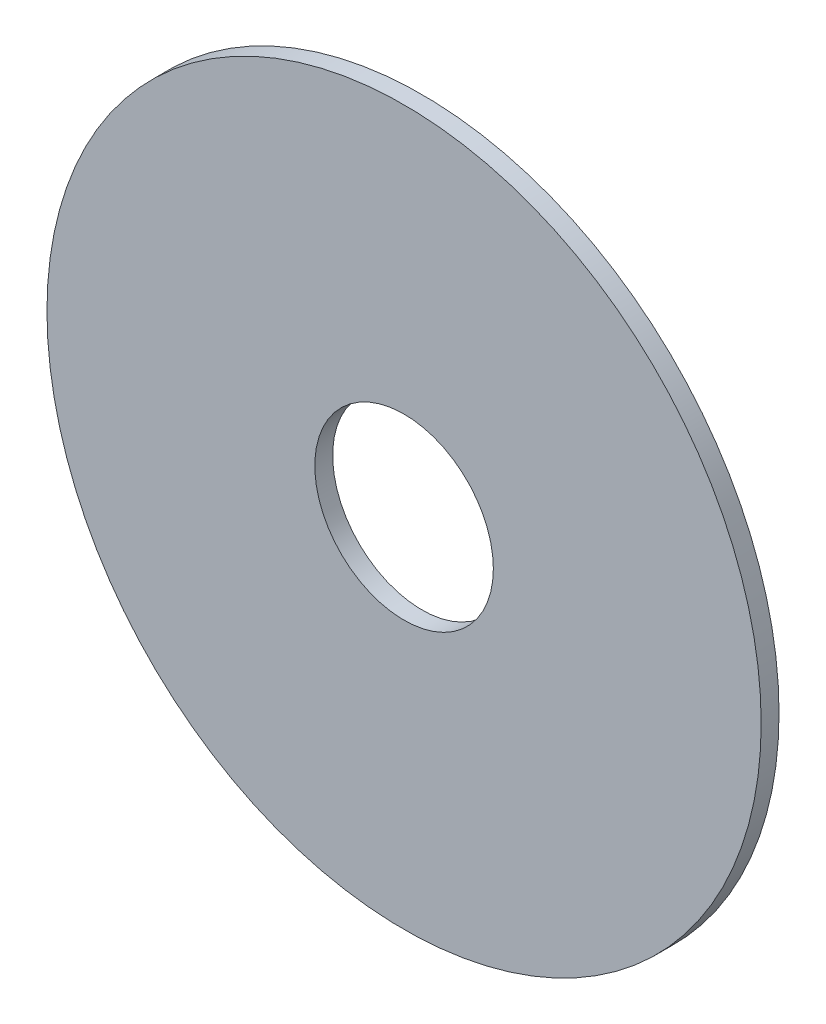
ISO-10303-21;
HEADER;
FILE_DESCRIPTION(('STEP AP214'),'2;1');
FILE_NAME('part.step','',(''),(''),'','','');
FILE_SCHEMA(('AUTOMOTIVE_DESIGN { 1 0 10303 214 1 1 1 1 }'));
ENDSEC;
DATA;
#1=APPLICATION_CONTEXT('core data for automotive mechanical design processes');
#2=APPLICATION_PROTOCOL_DEFINITION('international standard','automotive_design',2000,#1);
#3=PRODUCT_CONTEXT('',#1,'mechanical');
#4=PRODUCT('Part','Part','',(#3));
#5=PRODUCT_RELATED_PRODUCT_CATEGORY('part','',(#4));
#6=PRODUCT_DEFINITION_FORMATION('','',#4);
#7=PRODUCT_DEFINITION_CONTEXT('part definition',#1,'design');
#8=PRODUCT_DEFINITION('design','',#6,#7);
#9=PRODUCT_DEFINITION_SHAPE('','',#8);
#10=(LENGTH_UNIT() NAMED_UNIT(*) SI_UNIT(.MILLI.,.METRE.));
#11=(NAMED_UNIT(*) PLANE_ANGLE_UNIT() SI_UNIT($,.RADIAN.));
#12=(NAMED_UNIT(*) SI_UNIT($,.STERADIAN.) SOLID_ANGLE_UNIT());
#13=UNCERTAINTY_MEASURE_WITH_UNIT(LENGTH_MEASURE(1.E-05),#10,'distance_accuracy_value','');
#14=(GEOMETRIC_REPRESENTATION_CONTEXT(3) GLOBAL_UNCERTAINTY_ASSIGNED_CONTEXT((#13)) GLOBAL_UNIT_ASSIGNED_CONTEXT((#10,
#11,#12)) REPRESENTATION_CONTEXT('',''));
#15=CARTESIAN_POINT('',(0.,0.,0.));
#16=DIRECTION('',(0.,0.,1.));
#17=DIRECTION('',(1.,0.,0.));
#18=AXIS2_PLACEMENT_3D('',#15,#16,#17);
#19=CARTESIAN_POINT('',(0.,0.,1.));
#20=DIRECTION('',(0.,0.,-1.));
#21=DIRECTION('',(-1.,0.,0.));
#22=AXIS2_PLACEMENT_3D('',#19,#20,#21);
#23=CYLINDRICAL_SURFACE('',#22,20.);
#24=CARTESIAN_POINT('',(0.,0.,1.));
#25=DIRECTION('',(0.,0.,1.));
#26=DIRECTION('',(1.,0.,0.));
#27=AXIS2_PLACEMENT_3D('',#24,#25,#26);
#28=CIRCLE('',#27,20.);
#29=CARTESIAN_POINT('',(20.,0.,1.));
#30=VERTEX_POINT('',#29);
#31=EDGE_CURVE('E10',#30,#30,#28,.T.);
#32=ORIENTED_EDGE('',*,*,#31,.F.);
#33=EDGE_LOOP('',(#32));
#34=FACE_BOUND('',#33,.T.);
#35=CARTESIAN_POINT('',(0.,0.,0.));
#36=DIRECTION('',(0.,0.,1.));
#37=DIRECTION('',(1.,0.,0.));
#38=AXIS2_PLACEMENT_3D('',#35,#36,#37);
#39=CIRCLE('',#38,20.);
#40=CARTESIAN_POINT('',(20.,0.,0.));
#41=VERTEX_POINT('',#40);
#42=EDGE_CURVE('E38',#41,#41,#39,.T.);
#43=ORIENTED_EDGE('',*,*,#42,.T.);
#44=EDGE_LOOP('',(#43));
#45=FACE_BOUND('',#44,.T.);
#46=ADVANCED_FACE('F31',(#34,#45),#23,.T.);
#47=CARTESIAN_POINT('',(0.,0.,1.));
#48=DIRECTION('',(0.,0.,1.));
#49=DIRECTION('',(1.,0.,0.));
#50=AXIS2_PLACEMENT_3D('',#47,#48,#49);
#51=PLANE('',#50);
#52=CARTESIAN_POINT('',(0.,0.,1.));
#53=DIRECTION('',(0.,0.,1.));
#54=DIRECTION('',(1.,0.,0.));
#55=AXIS2_PLACEMENT_3D('',#52,#53,#54);
#56=CIRCLE('',#55,5.);
#57=CARTESIAN_POINT('',(5.,0.,1.));
#58=VERTEX_POINT('',#57);
#59=EDGE_CURVE('E44',#58,#58,#56,.T.);
#60=ORIENTED_EDGE('',*,*,#59,.F.);
#61=EDGE_LOOP('',(#60));
#62=FACE_BOUND('',#61,.T.);
#63=ORIENTED_EDGE('',*,*,#31,.T.);
#64=EDGE_LOOP('',(#63));
#65=FACE_BOUND('',#64,.T.);
#66=ADVANCED_FACE('F60',(#62,#65),#51,.T.);
#67=CARTESIAN_POINT('',(0.,0.,0.));
#68=DIRECTION('',(0.,0.,1.));
#69=DIRECTION('',(1.,0.,0.));
#70=AXIS2_PLACEMENT_3D('',#67,#68,#69);
#71=PLANE('',#70);
#72=CARTESIAN_POINT('',(0.,0.,0.));
#73=DIRECTION('',(0.,0.,1.));
#74=DIRECTION('',(1.,0.,0.));
#75=AXIS2_PLACEMENT_3D('',#72,#73,#74);
#76=CIRCLE('',#75,5.);
#77=CARTESIAN_POINT('',(5.,0.,0.));
#78=VERTEX_POINT('',#77);
#79=EDGE_CURVE('E34',#78,#78,#76,.T.);
#80=ORIENTED_EDGE('',*,*,#79,.T.);
#81=EDGE_LOOP('',(#80));
#82=FACE_BOUND('',#81,.T.);
#83=ORIENTED_EDGE('',*,*,#42,.F.);
#84=EDGE_LOOP('',(#83));
#85=FACE_BOUND('',#84,.T.);
#86=ADVANCED_FACE('F51',(#82,#85),#71,.F.);
#87=CARTESIAN_POINT('',(0.,0.,-3.));
#88=DIRECTION('',(0.,0.,1.));
#89=DIRECTION('',(1.,0.,0.));
#90=AXIS2_PLACEMENT_3D('',#87,#88,#89);
#91=CYLINDRICAL_SURFACE('',#90,5.);
#92=ORIENTED_EDGE('',*,*,#59,.T.);
#93=EDGE_LOOP('',(#92));
#94=FACE_BOUND('',#93,.T.);
#95=ORIENTED_EDGE('',*,*,#79,.F.);
#96=EDGE_LOOP('',(#95));
#97=FACE_BOUND('',#96,.T.);
#98=ADVANCED_FACE('F54',(#94,#97),#91,.F.);
#99=CLOSED_SHELL('',(#46,#66,#86,#98));
#100=MANIFOLD_SOLID_BREP('B2',#99);
#101=ADVANCED_BREP_SHAPE_REPRESENTATION('',(#18,#100),#14);
#102=SHAPE_DEFINITION_REPRESENTATION(#9,#101);
ENDSEC;
END-ISO-10303-21;
